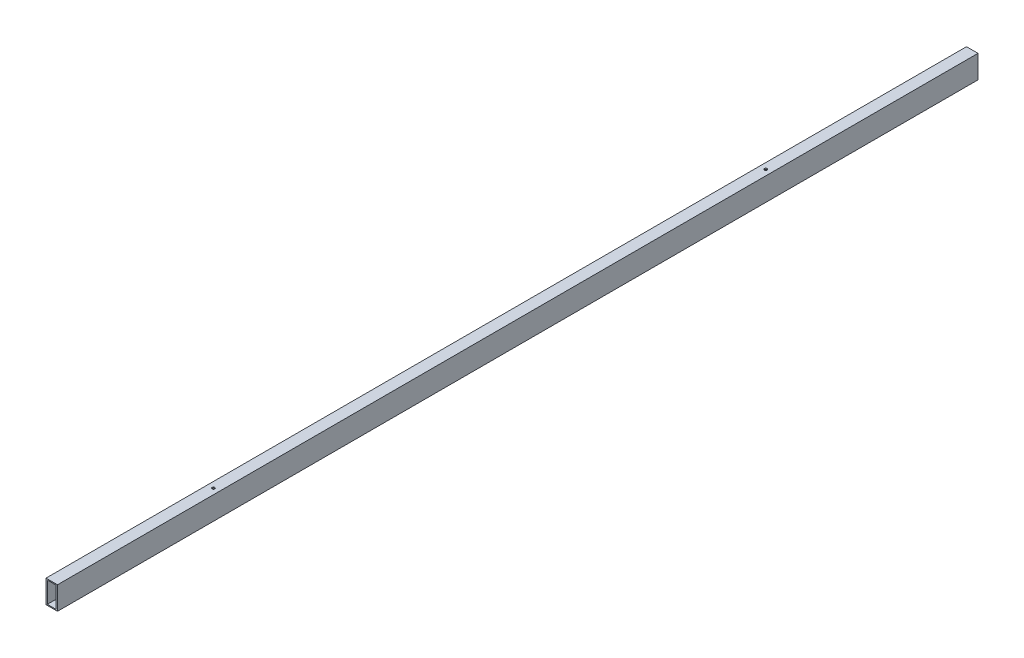
ISO-10303-21;
HEADER;
FILE_DESCRIPTION(('STEP AP214'),'2;1');
FILE_NAME('part.step','',(''),(''),'','','');
FILE_SCHEMA(('AUTOMOTIVE_DESIGN { 1 0 10303 214 1 1 1 1 }'));
ENDSEC;
DATA;
#1=APPLICATION_CONTEXT('core data for automotive mechanical design processes');
#2=APPLICATION_PROTOCOL_DEFINITION('international standard','automotive_design',2000,#1);
#3=PRODUCT_CONTEXT('',#1,'mechanical');
#4=PRODUCT('Part','Part','',(#3));
#5=PRODUCT_RELATED_PRODUCT_CATEGORY('part','',(#4));
#6=PRODUCT_DEFINITION_FORMATION('','',#4);
#7=PRODUCT_DEFINITION_CONTEXT('part definition',#1,'design');
#8=PRODUCT_DEFINITION('design','',#6,#7);
#9=PRODUCT_DEFINITION_SHAPE('','',#8);
#10=(LENGTH_UNIT() NAMED_UNIT(*) SI_UNIT(.MILLI.,.METRE.));
#11=(NAMED_UNIT(*) PLANE_ANGLE_UNIT() SI_UNIT($,.RADIAN.));
#12=(NAMED_UNIT(*) SI_UNIT($,.STERADIAN.) SOLID_ANGLE_UNIT());
#13=UNCERTAINTY_MEASURE_WITH_UNIT(LENGTH_MEASURE(1.E-05),#10,'distance_accuracy_value','');
#14=(GEOMETRIC_REPRESENTATION_CONTEXT(3) GLOBAL_UNCERTAINTY_ASSIGNED_CONTEXT((#13)) GLOBAL_UNIT_ASSIGNED_CONTEXT((#10,
#11,#12)) REPRESENTATION_CONTEXT('',''));
#15=CARTESIAN_POINT('',(0.,0.,0.));
#16=DIRECTION('',(0.,0.,1.));
#17=DIRECTION('',(1.,0.,0.));
#18=AXIS2_PLACEMENT_3D('',#15,#16,#17);
#19=CARTESIAN_POINT('',(0.,0.,2000.));
#20=DIRECTION('',(0.,0.,-1.));
#21=DIRECTION('',(-1.,0.,0.));
#22=AXIS2_PLACEMENT_3D('',#19,#20,#21);
#23=PLANE('',#22);
#24=DIRECTION('',(0.,1.,0.));
#25=VECTOR('',#24,1.);
#26=CARTESIAN_POINT('',(12.5,-25.,2000.));
#27=LINE('',#26,#25);
#28=CARTESIAN_POINT('',(12.5,-25.,2000.));
#29=VERTEX_POINT('',#28);
#30=CARTESIAN_POINT('',(12.5,25.,2000.));
#31=VERTEX_POINT('',#30);
#32=EDGE_CURVE('E138',#29,#31,#27,.T.);
#33=ORIENTED_EDGE('',*,*,#32,.T.);
#34=DIRECTION('',(-1.,0.,0.));
#35=VECTOR('',#34,1.);
#36=CARTESIAN_POINT('',(-12.5,25.,2000.));
#37=LINE('',#36,#35);
#38=CARTESIAN_POINT('',(-12.5,25.,2000.));
#39=VERTEX_POINT('',#38);
#40=EDGE_CURVE('E141',#31,#39,#37,.T.);
#41=ORIENTED_EDGE('',*,*,#40,.T.);
#42=DIRECTION('',(0.,-1.,0.));
#43=VECTOR('',#42,1.);
#44=CARTESIAN_POINT('',(-12.5,-25.,2000.));
#45=LINE('',#44,#43);
#46=CARTESIAN_POINT('',(-12.5,-25.,2000.));
#47=VERTEX_POINT('',#46);
#48=EDGE_CURVE('E144',#39,#47,#45,.T.);
#49=ORIENTED_EDGE('',*,*,#48,.T.);
#50=DIRECTION('',(1.,0.,0.));
#51=VECTOR('',#50,1.);
#52=CARTESIAN_POINT('',(-12.5,-25.,2000.));
#53=LINE('',#52,#51);
#54=EDGE_CURVE('E146',#47,#29,#53,.T.);
#55=ORIENTED_EDGE('',*,*,#54,.T.);
#56=EDGE_LOOP('',(#33,#41,#49,#55));
#57=FACE_BOUND('',#56,.T.);
#58=DIRECTION('',(0.,1.,0.));
#59=VECTOR('',#58,1.);
#60=CARTESIAN_POINT('',(9.5433189869806,-22.8107344632768,2000.));
#61=LINE('',#60,#59);
#62=CARTESIAN_POINT('',(9.5433189869806,-22.8107344632768,2000.));
#63=VERTEX_POINT('',#62);
#64=CARTESIAN_POINT('',(9.5433189869806,22.8107344632768,2000.));
#65=VERTEX_POINT('',#64);
#66=EDGE_CURVE('E100',#63,#65,#61,.T.);
#67=ORIENTED_EDGE('',*,*,#66,.F.);
#68=DIRECTION('',(1.,0.,0.));
#69=VECTOR('',#68,1.);
#70=CARTESIAN_POINT('',(-9.5433189869806,-22.8107344632768,2000.));
#71=LINE('',#70,#69);
#72=CARTESIAN_POINT('',(-9.5433189869806,-22.8107344632768,2000.));
#73=VERTEX_POINT('',#72);
#74=EDGE_CURVE('E122',#73,#63,#71,.T.);
#75=ORIENTED_EDGE('',*,*,#74,.F.);
#76=DIRECTION('',(0.,-1.,0.));
#77=VECTOR('',#76,1.);
#78=CARTESIAN_POINT('',(-9.5433189869806,-22.8107344632768,2000.));
#79=LINE('',#78,#77);
#80=CARTESIAN_POINT('',(-9.5433189869806,22.8107344632768,2000.));
#81=VERTEX_POINT('',#80);
#82=EDGE_CURVE('E120',#81,#73,#79,.T.);
#83=ORIENTED_EDGE('',*,*,#82,.F.);
#84=DIRECTION('',(-1.,0.,0.));
#85=VECTOR('',#84,1.);
#86=CARTESIAN_POINT('',(-9.5433189869806,22.8107344632768,2000.));
#87=LINE('',#86,#85);
#88=EDGE_CURVE('E108',#65,#81,#87,.T.);
#89=ORIENTED_EDGE('',*,*,#88,.F.);
#90=EDGE_LOOP('',(#67,#75,#83,#89));
#91=FACE_BOUND('',#90,.T.);
#92=ADVANCED_FACE('F33',(#57,#91),#23,.F.);
#93=CARTESIAN_POINT('',(0.,0.,0.));
#94=DIRECTION('',(0.,0.,-1.));
#95=DIRECTION('',(-1.,0.,0.));
#96=AXIS2_PLACEMENT_3D('',#93,#94,#95);
#97=PLANE('',#96);
#98=DIRECTION('',(0.,1.,0.));
#99=VECTOR('',#98,1.);
#100=CARTESIAN_POINT('',(12.5,-25.,0.));
#101=LINE('',#100,#99);
#102=CARTESIAN_POINT('',(12.5,-25.,0.));
#103=VERTEX_POINT('',#102);
#104=CARTESIAN_POINT('',(12.5,25.,0.));
#105=VERTEX_POINT('',#104);
#106=EDGE_CURVE('E116',#103,#105,#101,.T.);
#107=ORIENTED_EDGE('',*,*,#106,.F.);
#108=DIRECTION('',(1.,0.,0.));
#109=VECTOR('',#108,1.);
#110=CARTESIAN_POINT('',(-12.5,-25.,0.));
#111=LINE('',#110,#109);
#112=CARTESIAN_POINT('',(-12.5,-25.,0.));
#113=VERTEX_POINT('',#112);
#114=EDGE_CURVE('E142',#113,#103,#111,.T.);
#115=ORIENTED_EDGE('',*,*,#114,.F.);
#116=DIRECTION('',(0.,-1.,0.));
#117=VECTOR('',#116,1.);
#118=CARTESIAN_POINT('',(-12.5,-25.,0.));
#119=LINE('',#118,#117);
#120=CARTESIAN_POINT('',(-12.5,25.,0.));
#121=VERTEX_POINT('',#120);
#122=EDGE_CURVE('E153',#121,#113,#119,.T.);
#123=ORIENTED_EDGE('',*,*,#122,.F.);
#124=DIRECTION('',(-1.,0.,0.));
#125=VECTOR('',#124,1.);
#126=CARTESIAN_POINT('',(-12.5,25.,0.));
#127=LINE('',#126,#125);
#128=EDGE_CURVE('E151',#105,#121,#127,.T.);
#129=ORIENTED_EDGE('',*,*,#128,.F.);
#130=EDGE_LOOP('',(#107,#115,#123,#129));
#131=FACE_BOUND('',#130,.T.);
#132=DIRECTION('',(1.,0.,0.));
#133=VECTOR('',#132,1.);
#134=CARTESIAN_POINT('',(-9.5433189869806,-22.8107344632768,0.));
#135=LINE('',#134,#133);
#136=CARTESIAN_POINT('',(-9.5433189869806,-22.8107344632768,0.));
#137=VERTEX_POINT('',#136);
#138=CARTESIAN_POINT('',(9.5433189869806,-22.8107344632768,0.));
#139=VERTEX_POINT('',#138);
#140=EDGE_CURVE('E109',#137,#139,#135,.T.);
#141=ORIENTED_EDGE('',*,*,#140,.T.);
#142=DIRECTION('',(0.,1.,0.));
#143=VECTOR('',#142,1.);
#144=CARTESIAN_POINT('',(9.5433189869806,-22.8107344632768,0.));
#145=LINE('',#144,#143);
#146=CARTESIAN_POINT('',(9.5433189869806,22.8107344632768,0.));
#147=VERTEX_POINT('',#146);
#148=EDGE_CURVE('E58',#139,#147,#145,.T.);
#149=ORIENTED_EDGE('',*,*,#148,.T.);
#150=DIRECTION('',(-1.,0.,0.));
#151=VECTOR('',#150,1.);
#152=CARTESIAN_POINT('',(-9.5433189869806,22.8107344632768,0.));
#153=LINE('',#152,#151);
#154=CARTESIAN_POINT('',(-9.5433189869806,22.8107344632768,0.));
#155=VERTEX_POINT('',#154);
#156=EDGE_CURVE('E115',#147,#155,#153,.T.);
#157=ORIENTED_EDGE('',*,*,#156,.T.);
#158=DIRECTION('',(0.,-1.,0.));
#159=VECTOR('',#158,1.);
#160=CARTESIAN_POINT('',(-9.5433189869806,-22.8107344632768,0.));
#161=LINE('',#160,#159);
#162=EDGE_CURVE('E130',#155,#137,#161,.T.);
#163=ORIENTED_EDGE('',*,*,#162,.T.);
#164=EDGE_LOOP('',(#141,#149,#157,#163));
#165=FACE_BOUND('',#164,.T.);
#166=ADVANCED_FACE('F201',(#131,#165),#97,.T.);
#167=CARTESIAN_POINT('',(12.5,-25.,2000.));
#168=DIRECTION('',(-1.,0.,0.));
#169=DIRECTION('',(0.,0.,1.));
#170=AXIS2_PLACEMENT_3D('',#167,#168,#169);
#171=PLANE('',#170);
#172=ORIENTED_EDGE('',*,*,#106,.T.);
#173=DIRECTION('',(0.,0.,-1.));
#174=VECTOR('',#173,1.);
#175=CARTESIAN_POINT('',(12.5,25.,2000.));
#176=LINE('',#175,#174);
#177=EDGE_CURVE('E11',#31,#105,#176,.T.);
#178=ORIENTED_EDGE('',*,*,#177,.F.);
#179=ORIENTED_EDGE('',*,*,#32,.F.);
#180=DIRECTION('',(0.,0.,-1.));
#181=VECTOR('',#180,1.);
#182=CARTESIAN_POINT('',(12.5,-25.,2000.));
#183=LINE('',#182,#181);
#184=EDGE_CURVE('E148',#29,#103,#183,.T.);
#185=ORIENTED_EDGE('',*,*,#184,.T.);
#186=EDGE_LOOP('',(#172,#178,#179,#185));
#187=FACE_BOUND('',#186,.T.);
#188=ADVANCED_FACE('F35',(#187),#171,.F.);
#189=CARTESIAN_POINT('',(-12.5,25.,2000.));
#190=DIRECTION('',(0.,-1.,0.));
#191=DIRECTION('',(0.,0.,-1.));
#192=AXIS2_PLACEMENT_3D('',#189,#190,#191);
#193=PLANE('',#192);
#194=CARTESIAN_POINT('',(0.185438708109151,25.,448.872663574605));
#195=DIRECTION('',(0.,-1.,0.));
#196=DIRECTION('',(0.,0.,-1.));
#197=AXIS2_PLACEMENT_3D('',#194,#195,#196);
#198=CIRCLE('',#197,3.);
#199=CARTESIAN_POINT('',(0.185438708109151,25.,445.872663574605));
#200=VERTEX_POINT('',#199);
#201=EDGE_CURVE('E171',#200,#200,#198,.T.);
#202=ORIENTED_EDGE('',*,*,#201,.T.);
#203=EDGE_LOOP('',(#202));
#204=FACE_BOUND('',#203,.T.);
#205=CARTESIAN_POINT('',(0.185438708108263,25.,1648.87266357461));
#206=DIRECTION('',(0.,-1.,0.));
#207=DIRECTION('',(0.,0.,-1.));
#208=AXIS2_PLACEMENT_3D('',#205,#206,#207);
#209=CIRCLE('',#208,2.99999999999998);
#210=CARTESIAN_POINT('',(0.185438708108263,25.,1645.87266357461));
#211=VERTEX_POINT('',#210);
#212=EDGE_CURVE('E128',#211,#211,#209,.T.);
#213=ORIENTED_EDGE('',*,*,#212,.T.);
#214=EDGE_LOOP('',(#213));
#215=FACE_BOUND('',#214,.T.);
#216=ORIENTED_EDGE('',*,*,#128,.T.);
#217=DIRECTION('',(0.,0.,-1.));
#218=VECTOR('',#217,1.);
#219=CARTESIAN_POINT('',(-12.5,25.,2000.));
#220=LINE('',#219,#218);
#221=EDGE_CURVE('E42',#39,#121,#220,.T.);
#222=ORIENTED_EDGE('',*,*,#221,.F.);
#223=ORIENTED_EDGE('',*,*,#40,.F.);
#224=ORIENTED_EDGE('',*,*,#177,.T.);
#225=EDGE_LOOP('',(#216,#222,#223,#224));
#226=FACE_BOUND('',#225,.T.);
#227=ADVANCED_FACE('F182',(#204,#215,#226),#193,.F.);
#228=CARTESIAN_POINT('',(-12.5,-25.,2000.));
#229=DIRECTION('',(1.,0.,0.));
#230=DIRECTION('',(0.,0.,-1.));
#231=AXIS2_PLACEMENT_3D('',#228,#229,#230);
#232=PLANE('',#231);
#233=ORIENTED_EDGE('',*,*,#122,.T.);
#234=DIRECTION('',(0.,0.,-1.));
#235=VECTOR('',#234,1.);
#236=CARTESIAN_POINT('',(-12.5,-25.,2000.));
#237=LINE('',#236,#235);
#238=EDGE_CURVE('E158',#47,#113,#237,.T.);
#239=ORIENTED_EDGE('',*,*,#238,.F.);
#240=ORIENTED_EDGE('',*,*,#48,.F.);
#241=ORIENTED_EDGE('',*,*,#221,.T.);
#242=EDGE_LOOP('',(#233,#239,#240,#241));
#243=FACE_BOUND('',#242,.T.);
#244=ADVANCED_FACE('F215',(#243),#232,.F.);
#245=CARTESIAN_POINT('',(-12.5,-25.,2000.));
#246=DIRECTION('',(0.,1.,0.));
#247=DIRECTION('',(0.,0.,1.));
#248=AXIS2_PLACEMENT_3D('',#245,#246,#247);
#249=PLANE('',#248);
#250=CARTESIAN_POINT('',(0.185438708109151,-25.,448.872663574605));
#251=DIRECTION('',(0.,1.,0.));
#252=DIRECTION('',(0.,0.,1.));
#253=AXIS2_PLACEMENT_3D('',#250,#251,#252);
#254=CIRCLE('',#253,3.);
#255=CARTESIAN_POINT('',(0.185438708109151,-25.,451.872663574605));
#256=VERTEX_POINT('',#255);
#257=EDGE_CURVE('E235',#256,#256,#254,.T.);
#258=ORIENTED_EDGE('',*,*,#257,.T.);
#259=EDGE_LOOP('',(#258));
#260=FACE_BOUND('',#259,.T.);
#261=CARTESIAN_POINT('',(0.185438708108263,-25.,1648.87266357461));
#262=DIRECTION('',(0.,1.,0.));
#263=DIRECTION('',(0.,0.,1.));
#264=AXIS2_PLACEMENT_3D('',#261,#262,#263);
#265=CIRCLE('',#264,2.99999999999998);
#266=CARTESIAN_POINT('',(0.185438708108263,-25.,1651.87266357461));
#267=VERTEX_POINT('',#266);
#268=EDGE_CURVE('E165',#267,#267,#265,.T.);
#269=ORIENTED_EDGE('',*,*,#268,.T.);
#270=EDGE_LOOP('',(#269));
#271=FACE_BOUND('',#270,.T.);
#272=ORIENTED_EDGE('',*,*,#114,.T.);
#273=ORIENTED_EDGE('',*,*,#184,.F.);
#274=ORIENTED_EDGE('',*,*,#54,.F.);
#275=ORIENTED_EDGE('',*,*,#238,.T.);
#276=EDGE_LOOP('',(#272,#273,#274,#275));
#277=FACE_BOUND('',#276,.T.);
#278=ADVANCED_FACE('F212',(#260,#271,#277),#249,.F.);
#279=CARTESIAN_POINT('',(9.5433189869806,-22.8107344632768,2000.));
#280=DIRECTION('',(-1.,0.,0.));
#281=DIRECTION('',(0.,0.,1.));
#282=AXIS2_PLACEMENT_3D('',#279,#280,#281);
#283=PLANE('',#282);
#284=ORIENTED_EDGE('',*,*,#148,.F.);
#285=DIRECTION('',(0.,0.,-1.));
#286=VECTOR('',#285,1.);
#287=CARTESIAN_POINT('',(9.5433189869806,-22.8107344632768,2000.));
#288=LINE('',#287,#286);
#289=EDGE_CURVE('E104',#63,#139,#288,.T.);
#290=ORIENTED_EDGE('',*,*,#289,.F.);
#291=ORIENTED_EDGE('',*,*,#66,.T.);
#292=DIRECTION('',(0.,0.,-1.));
#293=VECTOR('',#292,1.);
#294=CARTESIAN_POINT('',(9.5433189869806,22.8107344632768,2000.));
#295=LINE('',#294,#293);
#296=EDGE_CURVE('E103',#65,#147,#295,.T.);
#297=ORIENTED_EDGE('',*,*,#296,.T.);
#298=EDGE_LOOP('',(#284,#290,#291,#297));
#299=FACE_BOUND('',#298,.T.);
#300=ADVANCED_FACE('F102',(#299),#283,.T.);
#301=CARTESIAN_POINT('',(-9.5433189869806,22.8107344632768,2000.));
#302=DIRECTION('',(0.,-1.,0.));
#303=DIRECTION('',(0.,0.,-1.));
#304=AXIS2_PLACEMENT_3D('',#301,#302,#303);
#305=PLANE('',#304);
#306=CARTESIAN_POINT('',(0.185438708109151,22.8107344632768,448.872663574605));
#307=DIRECTION('',(0.,-1.,0.));
#308=DIRECTION('',(0.,0.,-1.));
#309=AXIS2_PLACEMENT_3D('',#306,#307,#308);
#310=CIRCLE('',#309,3.);
#311=CARTESIAN_POINT('',(0.185438708109151,22.8107344632768,445.872663574605));
#312=VERTEX_POINT('',#311);
#313=EDGE_CURVE('E176',#312,#312,#310,.T.);
#314=ORIENTED_EDGE('',*,*,#313,.F.);
#315=EDGE_LOOP('',(#314));
#316=FACE_BOUND('',#315,.T.);
#317=CARTESIAN_POINT('',(0.185438708108263,22.8107344632768,1648.87266357461));
#318=DIRECTION('',(0.,-1.,0.));
#319=DIRECTION('',(0.,0.,-1.));
#320=AXIS2_PLACEMENT_3D('',#317,#318,#319);
#321=CIRCLE('',#320,2.99999999999998);
#322=CARTESIAN_POINT('',(0.185438708108263,22.8107344632768,1645.87266357461));
#323=VERTEX_POINT('',#322);
#324=EDGE_CURVE('E164',#323,#323,#321,.T.);
#325=ORIENTED_EDGE('',*,*,#324,.F.);
#326=EDGE_LOOP('',(#325));
#327=FACE_BOUND('',#326,.T.);
#328=ORIENTED_EDGE('',*,*,#156,.F.);
#329=ORIENTED_EDGE('',*,*,#296,.F.);
#330=ORIENTED_EDGE('',*,*,#88,.T.);
#331=DIRECTION('',(0.,0.,-1.));
#332=VECTOR('',#331,1.);
#333=CARTESIAN_POINT('',(-9.5433189869806,22.8107344632768,2000.));
#334=LINE('',#333,#332);
#335=EDGE_CURVE('E117',#81,#155,#334,.T.);
#336=ORIENTED_EDGE('',*,*,#335,.T.);
#337=EDGE_LOOP('',(#328,#329,#330,#336));
#338=FACE_BOUND('',#337,.T.);
#339=ADVANCED_FACE('F112',(#316,#327,#338),#305,.T.);
#340=CARTESIAN_POINT('',(-9.5433189869806,-22.8107344632768,2000.));
#341=DIRECTION('',(1.,0.,0.));
#342=DIRECTION('',(0.,0.,-1.));
#343=AXIS2_PLACEMENT_3D('',#340,#341,#342);
#344=PLANE('',#343);
#345=ORIENTED_EDGE('',*,*,#162,.F.);
#346=ORIENTED_EDGE('',*,*,#335,.F.);
#347=ORIENTED_EDGE('',*,*,#82,.T.);
#348=DIRECTION('',(0.,0.,-1.));
#349=VECTOR('',#348,1.);
#350=CARTESIAN_POINT('',(-9.5433189869806,-22.8107344632768,2000.));
#351=LINE('',#350,#349);
#352=EDGE_CURVE('E50',#73,#137,#351,.T.);
#353=ORIENTED_EDGE('',*,*,#352,.T.);
#354=EDGE_LOOP('',(#345,#346,#347,#353));
#355=FACE_BOUND('',#354,.T.);
#356=ADVANCED_FACE('F254',(#355),#344,.T.);
#357=CARTESIAN_POINT('',(-9.5433189869806,-22.8107344632768,2000.));
#358=DIRECTION('',(0.,1.,0.));
#359=DIRECTION('',(0.,0.,1.));
#360=AXIS2_PLACEMENT_3D('',#357,#358,#359);
#361=PLANE('',#360);
#362=CARTESIAN_POINT('',(0.185438708109151,-22.8107344632768,448.872663574605));
#363=DIRECTION('',(0.,1.,0.));
#364=DIRECTION('',(0.,0.,1.));
#365=AXIS2_PLACEMENT_3D('',#362,#363,#364);
#366=CIRCLE('',#365,3.);
#367=CARTESIAN_POINT('',(0.185438708109151,-22.8107344632768,451.872663574605));
#368=VERTEX_POINT('',#367);
#369=EDGE_CURVE('E37',#368,#368,#366,.T.);
#370=ORIENTED_EDGE('',*,*,#369,.F.);
#371=EDGE_LOOP('',(#370));
#372=FACE_BOUND('',#371,.T.);
#373=CARTESIAN_POINT('',(0.185438708108263,-22.8107344632768,1648.87266357461));
#374=DIRECTION('',(0.,1.,0.));
#375=DIRECTION('',(0.,0.,1.));
#376=AXIS2_PLACEMENT_3D('',#373,#374,#375);
#377=CIRCLE('',#376,2.99999999999998);
#378=CARTESIAN_POINT('',(0.185438708108263,-22.8107344632768,1651.87266357461));
#379=VERTEX_POINT('',#378);
#380=EDGE_CURVE('E162',#379,#379,#377,.T.);
#381=ORIENTED_EDGE('',*,*,#380,.F.);
#382=EDGE_LOOP('',(#381));
#383=FACE_BOUND('',#382,.T.);
#384=ORIENTED_EDGE('',*,*,#140,.F.);
#385=ORIENTED_EDGE('',*,*,#352,.F.);
#386=ORIENTED_EDGE('',*,*,#74,.T.);
#387=ORIENTED_EDGE('',*,*,#289,.T.);
#388=EDGE_LOOP('',(#384,#385,#386,#387));
#389=FACE_BOUND('',#388,.T.);
#390=ADVANCED_FACE('F198',(#372,#383,#389),#361,.T.);
#391=CARTESIAN_POINT('',(0.185438708108263,-25.,1648.87266357461));
#392=DIRECTION('',(0.,1.,0.));
#393=DIRECTION('',(0.,0.,1.));
#394=AXIS2_PLACEMENT_3D('',#391,#392,#393);
#395=CYLINDRICAL_SURFACE('',#394,2.99999999999998);
#396=ORIENTED_EDGE('',*,*,#380,.T.);
#397=EDGE_LOOP('',(#396));
#398=FACE_BOUND('',#397,.T.);
#399=ORIENTED_EDGE('',*,*,#268,.F.);
#400=EDGE_LOOP('',(#399));
#401=FACE_BOUND('',#400,.T.);
#402=ADVANCED_FACE('F188',(#398,#401),#395,.F.);
#403=ORIENTED_EDGE('',*,*,#324,.T.);
#404=EDGE_LOOP('',(#403));
#405=FACE_BOUND('',#404,.T.);
#406=ORIENTED_EDGE('',*,*,#212,.F.);
#407=EDGE_LOOP('',(#406));
#408=FACE_BOUND('',#407,.T.);
#409=ADVANCED_FACE('F185',(#405,#408),#395,.F.);
#410=CARTESIAN_POINT('',(0.185438708109151,-25.,448.872663574605));
#411=DIRECTION('',(0.,1.,0.));
#412=DIRECTION('',(0.,0.,1.));
#413=AXIS2_PLACEMENT_3D('',#410,#411,#412);
#414=CYLINDRICAL_SURFACE('',#413,3.);
#415=ORIENTED_EDGE('',*,*,#369,.T.);
#416=EDGE_LOOP('',(#415));
#417=FACE_BOUND('',#416,.T.);
#418=ORIENTED_EDGE('',*,*,#257,.F.);
#419=EDGE_LOOP('',(#418));
#420=FACE_BOUND('',#419,.T.);
#421=ADVANCED_FACE('F187',(#417,#420),#414,.F.);
#422=ORIENTED_EDGE('',*,*,#313,.T.);
#423=EDGE_LOOP('',(#422));
#424=FACE_BOUND('',#423,.T.);
#425=ORIENTED_EDGE('',*,*,#201,.F.);
#426=EDGE_LOOP('',(#425));
#427=FACE_BOUND('',#426,.T.);
#428=ADVANCED_FACE('F195',(#424,#427),#414,.F.);
#429=CLOSED_SHELL('',(#92,#166,#188,#227,#244,#278,#300,#339,#356,#390,#402,#409,#421,#428));
#430=MANIFOLD_SOLID_BREP('B2',#429);
#431=ADVANCED_BREP_SHAPE_REPRESENTATION('',(#18,#430),#14);
#432=SHAPE_DEFINITION_REPRESENTATION(#9,#431);
ENDSEC;
END-ISO-10303-21;
